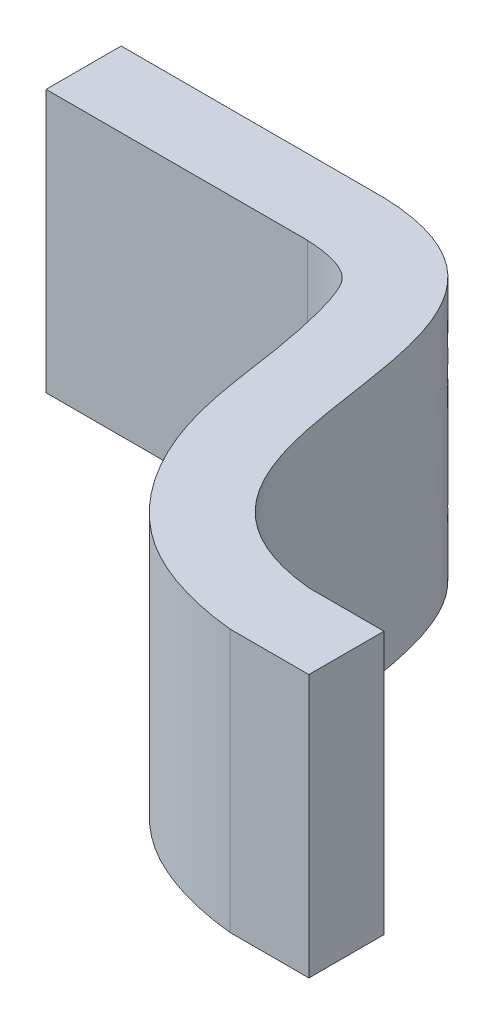
ISO-10303-21;
HEADER;
FILE_DESCRIPTION(('STEP AP214'),'2;1');
FILE_NAME('part.step','',(''),(''),'','','');
FILE_SCHEMA(('AUTOMOTIVE_DESIGN { 1 0 10303 214 1 1 1 1 }'));
ENDSEC;
DATA;
#1=APPLICATION_CONTEXT('core data for automotive mechanical design processes');
#2=APPLICATION_PROTOCOL_DEFINITION('international standard','automotive_design',2000,#1);
#3=PRODUCT_CONTEXT('',#1,'mechanical');
#4=PRODUCT('Part','Part','',(#3));
#5=PRODUCT_RELATED_PRODUCT_CATEGORY('part','',(#4));
#6=PRODUCT_DEFINITION_FORMATION('','',#4);
#7=PRODUCT_DEFINITION_CONTEXT('part definition',#1,'design');
#8=PRODUCT_DEFINITION('design','',#6,#7);
#9=PRODUCT_DEFINITION_SHAPE('','',#8);
#10=(LENGTH_UNIT() NAMED_UNIT(*) SI_UNIT(.MILLI.,.METRE.));
#11=(NAMED_UNIT(*) PLANE_ANGLE_UNIT() SI_UNIT($,.RADIAN.));
#12=(NAMED_UNIT(*) SI_UNIT($,.STERADIAN.) SOLID_ANGLE_UNIT());
#13=UNCERTAINTY_MEASURE_WITH_UNIT(LENGTH_MEASURE(1.E-05),#10,'distance_accuracy_value','');
#14=(GEOMETRIC_REPRESENTATION_CONTEXT(3) GLOBAL_UNCERTAINTY_ASSIGNED_CONTEXT((#13)) GLOBAL_UNIT_ASSIGNED_CONTEXT((#10,
#11,#12)) REPRESENTATION_CONTEXT('',''));
#15=CARTESIAN_POINT('',(0.,0.,0.));
#16=DIRECTION('',(0.,0.,1.));
#17=DIRECTION('',(1.,0.,0.));
#18=AXIS2_PLACEMENT_3D('',#15,#16,#17);
#19=CARTESIAN_POINT('',(0.381074398756027,-3.47690082967439,1.19999985356685));
#20=DIRECTION('',(0.,-1.,-4.37113882867379E-08));
#21=DIRECTION('',(1.,0.,0.));
#22=AXIS2_PLACEMENT_3D('',#19,#20,#21);
#23=PLANE('',#22);
#24=CARTESIAN_POINT('',(-6.65392560124397,-3.47690082093211,0.999999853566849));
#25=CARTESIAN_POINT('',(-6.6760213847098,-3.47690082083689,0.997821363378803));
#26=CARTESIAN_POINT('',(-6.69813368756547,-3.4769008206928,0.994524992319805));
#27=CARTESIAN_POINT('',(-6.74194760453987,-3.47690082027531,0.984973999806053));
#28=CARTESIAN_POINT('',(-6.76364199343851,-3.4769008200005,0.978687133446075));
#29=CARTESIAN_POINT('',(-6.8010868913745,-3.476900819368,0.964217061903684));
#30=CARTESIAN_POINT('',(-6.81710358266756,-3.47690081904135,0.956744157681285));
#31=CARTESIAN_POINT('',(-6.84769864594612,-3.47690081828303,0.939395910983816));
#32=CARTESIAN_POINT('',(-6.86228342605002,-3.47690081785186,0.929532028551955));
#33=CARTESIAN_POINT('',(-6.88912475678651,-3.47690081690445,0.907857820702243));
#34=CARTESIAN_POINT('',(-6.90144309560176,-3.47690081639156,0.896124080689932));
#35=CARTESIAN_POINT('',(-6.92409093426443,-3.47690081528685,0.870851202194943));
#36=CARTESIAN_POINT('',(-6.93441702178863,-3.4769008146949,0.857309032186523));
#37=CARTESIAN_POINT('',(-6.96671116783855,-3.47690081254812,0.808196393991896));
#38=CARTESIAN_POINT('',(-6.98363339651492,-3.47690081085059,0.769361408858455));
#39=CARTESIAN_POINT('',(-7.00636675343762,-3.47690080782166,0.700067620687221));
#40=CARTESIAN_POINT('',(-7.01392037587509,-3.47690080650928,0.670043871769162));
#41=CARTESIAN_POINT('',(-7.02679822502435,-3.476900803861,0.60945829127765));
#42=CARTESIAN_POINT('',(-7.03211866901882,-3.47690080252507,0.578895637360986));
#43=CARTESIAN_POINT('',(-7.04522373011164,-3.47690079894623,0.497021351625423));
#44=CARTESIAN_POINT('',(-7.05225323067938,-3.47690079669872,0.445604528778748));
#45=CARTESIAN_POINT('',(-7.06582589653957,-3.47690079334914,0.368975045837079));
#46=CARTESIAN_POINT('',(-7.07085237182357,-3.47690079223664,0.343524079365538));
#47=CARTESIAN_POINT('',(-7.08288891244714,-3.47690079003342,0.293120201610462));
#48=CARTESIAN_POINT('',(-7.0898957194452,-3.47690078894266,0.268166543683047));
#49=CARTESIAN_POINT('',(-7.10753002382366,-3.4769007867616,0.218269493752244));
#50=CARTESIAN_POINT('',(-7.11829723428463,-3.47690078567323,0.19337055401301));
#51=CARTESIAN_POINT('',(-7.13813270077437,-3.47690078413505,0.158181114031212));
#52=CARTESIAN_POINT('',(-7.14532993400949,-3.47690078363948,0.146843820328245));
#53=CARTESIAN_POINT('',(-7.16104748346313,-3.47690078269053,0.125134406221757));
#54=CARTESIAN_POINT('',(-7.1695665343253,-3.47690078223712,0.114761377771714));
#55=CARTESIAN_POINT('',(-7.19090199977994,-3.47690078124645,0.0920974605824846));
#56=CARTESIAN_POINT('',(-7.20421803422598,-3.47690078072935,0.080267898890818));
#57=CARTESIAN_POINT('',(-7.23279289498044,-3.47690077980915,0.0592160823492663));
#58=CARTESIAN_POINT('',(-7.24805496936829,-3.47690077940623,0.0499982715306265));
#59=CARTESIAN_POINT('',(-7.28054440722777,-3.47690077870131,0.0338716888207507));
#60=CARTESIAN_POINT('',(-7.29782779482495,-3.47690077840435,0.0270780092305757));
#61=CARTESIAN_POINT('',(-7.33319650573112,-3.47690077791998,0.0159969269530957));
#62=CARTESIAN_POINT('',(-7.35128360657443,-3.47690077773283,0.0117154108145125));
#63=CARTESIAN_POINT('',(-7.38352182929289,-3.4769007774817,0.00597036540082577));
#64=CARTESIAN_POINT('',(-7.39760256337062,-3.47690077739915,0.00408168117578831));
#65=CARTESIAN_POINT('',(-7.4257638425411,-3.4769007772789,0.00133069078066276));
#66=CARTESIAN_POINT('',(-7.43984365839325,-3.47690077724089,0.000461089362855164));
#67=CARTESIAN_POINT('',(-7.45392560124401,-3.47690077722073,-1.46433151940948E-07));
#68=B_SPLINE_CURVE_WITH_KNOTS('',3,(#24,#25,#26,#27,#28,#29,#30,#31,#32,#33,#34,#35,#36,#37,#38,
#39,#40,#41,#42,#43,#44,#45,#46,#47,#48,#49,#50,#51,#52,#53,#54,#55,#56,#57,#58,#59,#60,#61,#62,
#63,#64,#65,#66,#67),.UNSPECIFIED.,.F.,.F.,(4,2,2,2,2,2,2,2,2,2,2,2,2,2,2,2,2,2,2,2,2,4),(0.,
0.0667821137090888,0.134301214684032,0.187128508823994,0.239707439757743,0.290518731452934,
0.341416294675061,0.466712259088971,0.55956301965451,0.652570428897923,0.808245450373597,
0.886023921415196,0.963675157190788,1.04458784966541,1.08478909463837,1.12495209032638,
1.17807587168457,1.2312895104201,1.28677003517691,1.34238004906255,1.38496468867345,
1.42724258099923),.UNSPECIFIED.);
#69=CARTESIAN_POINT('',(-6.65392560124397,-3.47690082093211,0.999999853566849));
#70=VERTEX_POINT('',#69);
#71=CARTESIAN_POINT('',(-7.45392560124397,-3.47690077722073,-1.46433150760572E-07));
#72=VERTEX_POINT('',#71);
#73=EDGE_CURVE('E11',#70,#72,#68,.T.);
#74=ORIENTED_EDGE('',*,*,#73,.F.);
#75=DIRECTION('',(-1.,0.,0.));
#76=VECTOR('',#75,1.);
#77=CARTESIAN_POINT('',(-6.45392560124397,-3.47690082093211,0.999999853566849));
#78=LINE('',#77,#76);
#79=CARTESIAN_POINT('',(-6.45392560124397,-3.47690082093211,0.999999853566849));
#80=VERTEX_POINT('',#79);
#81=EDGE_CURVE('E178',#80,#70,#78,.T.);
#82=ORIENTED_EDGE('',*,*,#81,.F.);
#83=DIRECTION('',(0.,4.37113878426487E-08,-0.999999999999999));
#84=VECTOR('',#83,1.);
#85=CARTESIAN_POINT('',(-6.45392560124397,-3.47690082967439,1.19999985356685));
#86=LINE('',#85,#84);
#87=CARTESIAN_POINT('',(-6.45392560124397,-3.47690082967439,1.19999985356685));
#88=VERTEX_POINT('',#87);
#89=EDGE_CURVE('E154',#88,#80,#86,.T.);
#90=ORIENTED_EDGE('',*,*,#89,.F.);
#91=DIRECTION('',(-1.,0.,0.));
#92=VECTOR('',#91,1.);
#93=CARTESIAN_POINT('',(-6.45392560124397,-3.47690082967439,1.19999985356685));
#94=LINE('',#93,#92);
#95=CARTESIAN_POINT('',(-6.66372477809197,-3.47690082967439,1.19999985356685));
#96=VERTEX_POINT('',#95);
#97=EDGE_CURVE('E147',#88,#96,#94,.T.);
#98=ORIENTED_EDGE('',*,*,#97,.T.);
#99=CARTESIAN_POINT('',(-6.66372477809197,-3.47690082967439,1.19999985356685));
#100=CARTESIAN_POINT('',(-6.68235816480651,-3.47690082959388,1.19815800024526));
#101=CARTESIAN_POINT('',(-6.70093498946342,-3.47690082948649,1.1957012238173));
#102=CARTESIAN_POINT('',(-6.73791221278168,-3.47690082921529,1.18949682423011));
#103=CARTESIAN_POINT('',(-6.75631214417819,-3.47690082905135,1.18574642673535));
#104=CARTESIAN_POINT('',(-6.79295513620438,-3.47690082866298,1.1768614504023));
#105=CARTESIAN_POINT('',(-6.8111952940445,-3.47690082843801,1.17171471620827));
#106=CARTESIAN_POINT('',(-6.84717172345389,-3.47690082792288,1.15992992349783));
#107=CARTESIAN_POINT('',(-6.86490837899947,-3.47690082763277,1.15329303778762));
#108=CARTESIAN_POINT('',(-6.90549462665057,-3.47690082686923,1.13582532460973));
#109=CARTESIAN_POINT('',(-6.92807290255751,-3.47690082636693,1.12433411949993));
#110=CARTESIAN_POINT('',(-6.97096829666688,-3.4769008252108,1.09788489937365));
#111=CARTESIAN_POINT('',(-6.9912955036889,-3.47690082455769,1.08294336266544));
#112=CARTESIAN_POINT('',(-7.02796037846709,-3.4769008231845,1.05152836561377));
#113=CARTESIAN_POINT('',(-7.04448684621663,-3.47690082247389,1.0352716695965));
#114=CARTESIAN_POINT('',(-7.07542126022009,-3.47690082096671,1.00079135092781));
#115=CARTESIAN_POINT('',(-7.08982362168071,-3.47690082016992,0.982562754126248));
#116=CARTESIAN_POINT('',(-7.11808537102814,-3.47690081841041,0.942309972603254));
#117=CARTESIAN_POINT('',(-7.1316696505039,-3.47690081743928,0.92009318612408));
#118=CARTESIAN_POINT('',(-7.15605550233222,-3.47690081543449,0.87422897098033));
#119=CARTESIAN_POINT('',(-7.16686079670802,-3.47690081440092,0.850583508813256));
#120=CARTESIAN_POINT('',(-7.18656671922941,-3.47690081220073,0.800248980346848));
#121=CARTESIAN_POINT('',(-7.19523524065515,-3.47690081103018,0.773470089068371));
#122=CARTESIAN_POINT('',(-7.20995546192352,-3.47690080865782,0.719196833192921));
#123=CARTESIAN_POINT('',(-7.21600397870321,-3.47690080745597,0.691701641089337));
#124=CARTESIAN_POINT('',(-7.22444466903982,-3.47690080548969,0.646718436338351));
#125=CARTESIAN_POINT('',(-7.22735928328766,-3.47690080472924,0.629321297123909));
#126=CARTESIAN_POINT('',(-7.23280873084802,-3.47690080320562,0.594464888859918));
#127=CARTESIAN_POINT('',(-7.235343477908,-3.47690080244245,0.577005606618711));
#128=CARTESIAN_POINT('',(-7.24043139259136,-3.47690080091635,0.542092659422763));
#129=CARTESIAN_POINT('',(-7.24298455656837,-3.47690080015343,0.524638994034042));
#130=CARTESIAN_POINT('',(-7.24852784389109,-3.47690079863081,0.489805448400219));
#131=CARTESIAN_POINT('',(-7.25151784908981,-3.47690079787111,0.472425549508168));
#132=CARTESIAN_POINT('',(-7.2593930344497,-3.47690079601736,0.430016740032559));
#133=CARTESIAN_POINT('',(-7.26452884999095,-3.47690079492524,0.405032011816055));
#134=CARTESIAN_POINT('',(-7.27334542318719,-3.47690079329834,0.367812734985582));
#135=CARTESIAN_POINT('',(-7.27647049737491,-3.47690079275781,0.35544681434155));
#136=CARTESIAN_POINT('',(-7.28323298853228,-3.47690079168298,0.33085792341073));
#137=CARTESIAN_POINT('',(-7.28687011761276,-3.47690079114867,0.318634876950399));
#138=CARTESIAN_POINT('',(-7.29334407740757,-3.47690079030677,0.299373221215939));
#139=CARTESIAN_POINT('',(-7.2959066269859,-3.47690078999518,0.292243807444687));
#140=CARTESIAN_POINT('',(-7.30148473904446,-3.47690078937994,0.27817171935325));
#141=CARTESIAN_POINT('',(-7.30449961539945,-3.47690078907628,0.271228780663558));
#142=CARTESIAN_POINT('',(-7.31076754414832,-3.47690078854217,0.25899976841146));
#143=CARTESIAN_POINT('',(-7.31387365469767,-3.47690078830855,0.253644591727611));
#144=CARTESIAN_POINT('',(-7.32080381678023,-3.47690078789956,0.24431585073112));
#145=CARTESIAN_POINT('',(-7.32450000384901,-3.47690078772056,0.240253829951382));
#146=CARTESIAN_POINT('',(-7.33394897363332,-3.47690078736822,0.232075819782309));
#147=CARTESIAN_POINT('',(-7.33998642044214,-3.47690078721245,0.228303905554507));
#148=CARTESIAN_POINT('',(-7.34920308092036,-3.47690078697539,0.223112945284578));
#149=CARTESIAN_POINT('',(-7.35228960650534,-3.47690078689613,0.2214660138922));
#150=CARTESIAN_POINT('',(-7.35857989092758,-3.47690078677323,0.218417225329413));
#151=CARTESIAN_POINT('',(-7.36178332741555,-3.4769007867295,0.217014747998715));
#152=CARTESIAN_POINT('',(-7.37090352258754,-3.4769007866004,0.21346489598315));
#153=CARTESIAN_POINT('',(-7.37693693346537,-3.47690078650972,0.211621552848284));
#154=CARTESIAN_POINT('',(-7.38670569686491,-3.4769007863772,0.209137060916208));
#155=CARTESIAN_POINT('',(-7.39039887638499,-3.4769007863303,0.20830954664572));
#156=CARTESIAN_POINT('',(-7.39781445722382,-3.47690078625616,0.206799511724327));
#157=CARTESIAN_POINT('',(-7.40153685423347,-3.47690078622893,0.206116970094035));
#158=CARTESIAN_POINT('',(-7.41389968086125,-3.47690078614263,0.204031929793533));
#159=CARTESIAN_POINT('',(-7.42257948480063,-3.47690078608874,0.20286096389716));
#160=CARTESIAN_POINT('',(-7.43563044947402,-3.47690078602721,0.201476448842084));
#161=CARTESIAN_POINT('',(-7.43998307619468,-3.47690078600992,0.201077075020748));
#162=CARTESIAN_POINT('',(-7.44869872182374,-3.4769007859817,0.200423844313514));
#163=CARTESIAN_POINT('',(-7.45306173976726,-3.47690078597078,0.20016997440803));
#164=CARTESIAN_POINT('',(-7.45742938297997,-3.476900785963,0.199999853566849));
#165=B_SPLINE_CURVE_WITH_KNOTS('',3,(#99,#100,#101,#102,#103,#104,#105,#106,#107,#108,#109,#110,
#111,#112,#113,#114,#115,#116,#117,#118,#119,#120,#121,#122,#123,#124,#125,#126,#127,#128,#129,
#130,#131,#132,#133,#134,#135,#136,#137,#138,#139,#140,#141,#142,#143,#144,#145,#146,#147,#148,
#149,#150,#151,#152,#153,#154,#155,#156,#157,#158,#159,#160,#161,#162,#163,#164),.UNSPECIFIED.,
.F.,.F.,(4,2,2,2,2,2,2,2,2,2,2,2,2,2,2,2,2,2,2,2,2,2,2,2,2,2,2,2,2,2,2,2,4),(0.,
0.0561681589095707,0.112457534383138,0.16925357861237,0.226005077906886,0.301715004036544,
0.377070566346001,0.446424912055152,0.515958475234817,0.593880428548584,0.671697467408244,
0.75596451716301,0.84033365838221,0.89324779263184,0.946173923407372,0.999089848164164,
1.05199148781442,1.12847716172405,1.16673541076623,1.20497223539784,1.22769072756634,
1.25037510056687,1.26886797593494,1.28517999290264,1.30634908955327,1.3168513921173,
1.32732665061524,1.34619861049414,1.35755137220421,1.36890248990409,1.39515927363249,
1.40827024085607,1.42138003473644),.UNSPECIFIED.);
#166=CARTESIAN_POINT('',(-7.45742938297997,-3.476900785963,0.199999853566849));
#167=VERTEX_POINT('',#166);
#168=EDGE_CURVE('E196',#96,#167,#165,.T.);
#169=ORIENTED_EDGE('',*,*,#168,.T.);
#170=DIRECTION('',(1.,0.,0.));
#171=VECTOR('',#170,1.);
#172=CARTESIAN_POINT('',(-8.15392560124397,-3.476900785963,0.199999853566847));
#173=LINE('',#172,#171);
#174=CARTESIAN_POINT('',(-8.15392560124397,-3.476900785963,0.199999853566849));
#175=VERTEX_POINT('',#174);
#176=EDGE_CURVE('E102',#175,#167,#173,.T.);
#177=ORIENTED_EDGE('',*,*,#176,.F.);
#178=DIRECTION('',(0.,4.37113900630947E-08,-0.999999999999999));
#179=VECTOR('',#178,1.);
#180=CARTESIAN_POINT('',(-8.15392560124397,-3.476900785963,0.199999853566849));
#181=LINE('',#180,#179);
#182=CARTESIAN_POINT('',(-8.15392560124397,-3.47690077722073,-1.46433150760572E-07));
#183=VERTEX_POINT('',#182);
#184=EDGE_CURVE('E90',#175,#183,#181,.T.);
#185=ORIENTED_EDGE('',*,*,#184,.T.);
#186=DIRECTION('',(-1.,0.,0.));
#187=VECTOR('',#186,1.);
#188=CARTESIAN_POINT('',(-7.45392560124397,-3.47690077722073,-1.46433150760572E-07));
#189=LINE('',#188,#187);
#190=EDGE_CURVE('E100',#72,#183,#189,.T.);
#191=ORIENTED_EDGE('',*,*,#190,.F.);
#192=EDGE_LOOP('',(#74,#82,#90,#98,#169,#177,#185,#191));
#193=FACE_BOUND('',#192,.T.);
#194=ADVANCED_FACE('F17',(#193),#23,.T.);
#195=CARTESIAN_POINT('',(0.381074398756027,-2.77690082967439,1.19999988416482));
#196=DIRECTION('',(0.,-1.,-4.37113882867379E-08));
#197=DIRECTION('',(1.,0.,0.));
#198=AXIS2_PLACEMENT_3D('',#195,#196,#197);
#199=PLANE('',#198);
#200=DIRECTION('',(-1.,0.,0.));
#201=VECTOR('',#200,1.);
#202=CARTESIAN_POINT('',(-6.45392560124397,-2.77690082093212,0.999999884164821));
#203=LINE('',#202,#201);
#204=CARTESIAN_POINT('',(-6.45392560124397,-2.77690082093211,0.999999884164821));
#205=VERTEX_POINT('',#204);
#206=CARTESIAN_POINT('',(-6.65392560124397,-2.77690082093211,0.999999884164821));
#207=VERTEX_POINT('',#206);
#208=EDGE_CURVE('E30',#205,#207,#203,.T.);
#209=ORIENTED_EDGE('',*,*,#208,.T.);
#210=CARTESIAN_POINT('',(-6.65392560124397,-2.77690082093211,0.999999884164821));
#211=CARTESIAN_POINT('',(-6.6760213847098,-2.77690082083688,0.997821393976774));
#212=CARTESIAN_POINT('',(-6.69813368756547,-2.7769008206928,0.994525022917776));
#213=CARTESIAN_POINT('',(-6.74194760453987,-2.77690082027532,0.984974030404025));
#214=CARTESIAN_POINT('',(-6.76364199343851,-2.77690082000051,0.978687164044047));
#215=CARTESIAN_POINT('',(-6.8010868913745,-2.776900819368,0.964217092501656));
#216=CARTESIAN_POINT('',(-6.81710358266756,-2.77690081904135,0.956744188279256));
#217=CARTESIAN_POINT('',(-6.84769864594612,-2.77690081828303,0.939395941581787));
#218=CARTESIAN_POINT('',(-6.86228342605002,-2.77690081785186,0.929532059149927));
#219=CARTESIAN_POINT('',(-6.88912475678651,-2.77690081690445,0.907857851300215));
#220=CARTESIAN_POINT('',(-6.90144309560176,-2.77690081639156,0.896124111287903));
#221=CARTESIAN_POINT('',(-6.92409093426443,-2.77690081528685,0.870851232792914));
#222=CARTESIAN_POINT('',(-6.93441702178863,-2.7769008146949,0.857309062784495));
#223=CARTESIAN_POINT('',(-6.96671116783855,-2.77690081254811,0.808196424589869));
#224=CARTESIAN_POINT('',(-6.98363339651492,-2.77690081085059,0.769361439456426));
#225=CARTESIAN_POINT('',(-7.00636675343762,-2.77690080782166,0.700067651285191));
#226=CARTESIAN_POINT('',(-7.01392037587509,-2.77690080650928,0.670043902367133));
#227=CARTESIAN_POINT('',(-7.02679822502435,-2.776900803861,0.609458321875621));
#228=CARTESIAN_POINT('',(-7.03211866901882,-2.77690080252507,0.578895667958958));
#229=CARTESIAN_POINT('',(-7.04522373011164,-2.77690079894623,0.497021382223394));
#230=CARTESIAN_POINT('',(-7.05225323067938,-2.77690079669873,0.445604559376719));
#231=CARTESIAN_POINT('',(-7.06582589653957,-2.77690079334914,0.368975076435051));
#232=CARTESIAN_POINT('',(-7.07085237182358,-2.77690079223665,0.34352410996351));
#233=CARTESIAN_POINT('',(-7.08288891244714,-2.77690079003342,0.293120232208435));
#234=CARTESIAN_POINT('',(-7.0898957194452,-2.77690078894266,0.26816657428102));
#235=CARTESIAN_POINT('',(-7.10753002382366,-2.77690078676159,0.218269524350215));
#236=CARTESIAN_POINT('',(-7.11829723428463,-2.77690078567323,0.19337058461098));
#237=CARTESIAN_POINT('',(-7.13813270077437,-2.77690078413505,0.158181144629183));
#238=CARTESIAN_POINT('',(-7.14532993400949,-2.77690078363948,0.146843850926217));
#239=CARTESIAN_POINT('',(-7.16104748346313,-2.77690078269053,0.125134436819728));
#240=CARTESIAN_POINT('',(-7.1695665343253,-2.77690078223712,0.114761408369686));
#241=CARTESIAN_POINT('',(-7.19090199977994,-2.77690078124645,0.0920974911804555));
#242=CARTESIAN_POINT('',(-7.20421803422598,-2.77690078072935,0.0802679294887893));
#243=CARTESIAN_POINT('',(-7.23279289498045,-2.77690077980915,0.0592161129472383));
#244=CARTESIAN_POINT('',(-7.24805496936829,-2.77690077940623,0.0499983021285984));
#245=CARTESIAN_POINT('',(-7.28054440722777,-2.77690077870131,0.0338717194187224));
#246=CARTESIAN_POINT('',(-7.29782779482495,-2.77690077840435,0.0270780398285472));
#247=CARTESIAN_POINT('',(-7.33319650573112,-2.77690077791998,0.0159969575510673));
#248=CARTESIAN_POINT('',(-7.35128360657443,-2.77690077773283,0.0117154414124843));
#249=CARTESIAN_POINT('',(-7.38352182929289,-2.7769007774817,0.00597039599879767));
#250=CARTESIAN_POINT('',(-7.39760256337062,-2.77690077739915,0.00408171177376016));
#251=CARTESIAN_POINT('',(-7.4257638425411,-2.7769007772789,0.00133072137863451));
#252=CARTESIAN_POINT('',(-7.43984365839325,-2.77690077724089,0.000461119960826874));
#253=CARTESIAN_POINT('',(-7.45392560124401,-2.77690077722073,-1.1583518018464E-07));
#254=B_SPLINE_CURVE_WITH_KNOTS('',3,(#210,#211,#212,#213,#214,#215,#216,#217,#218,#219,#220,
#221,#222,#223,#224,#225,#226,#227,#228,#229,#230,#231,#232,#233,#234,#235,#236,#237,#238,#239,
#240,#241,#242,#243,#244,#245,#246,#247,#248,#249,#250,#251,#252,#253),.UNSPECIFIED.,.F.,.F.,(4,
2,2,2,2,2,2,2,2,2,2,2,2,2,2,2,2,2,2,2,2,4),(0.,0.0667821137090889,0.134301214684032,
0.187128508823994,0.239707439757743,0.290518731452934,0.34141629467506,0.466712259088972,
0.55956301965451,0.652570428897923,0.808245450373596,0.886023921415196,0.963675157190788,
1.04458784966541,1.08478909463837,1.12495209032638,1.17807587168457,1.2312895104201,
1.28677003517691,1.34238004906255,1.38496468867345,1.42724258099923),.UNSPECIFIED.);
#255=CARTESIAN_POINT('',(-7.45392560124397,-2.77690077722073,-1.15835178959856E-07));
#256=VERTEX_POINT('',#255);
#257=EDGE_CURVE('E157',#207,#256,#254,.T.);
#258=ORIENTED_EDGE('',*,*,#257,.T.);
#259=DIRECTION('',(-1.,0.,0.));
#260=VECTOR('',#259,1.);
#261=CARTESIAN_POINT('',(-7.45392560124397,-2.77690077722073,-1.15835178959856E-07));
#262=LINE('',#261,#260);
#263=CARTESIAN_POINT('',(-8.15392560124397,-2.77690077722073,-1.15835178959856E-07));
#264=VERTEX_POINT('',#263);
#265=EDGE_CURVE('E150',#256,#264,#262,.T.);
#266=ORIENTED_EDGE('',*,*,#265,.T.);
#267=DIRECTION('',(0.,4.37113878426487E-08,-0.999999999999999));
#268=VECTOR('',#267,1.);
#269=CARTESIAN_POINT('',(-8.15392560124397,-2.776900785963,0.199999884164821));
#270=LINE('',#269,#268);
#271=CARTESIAN_POINT('',(-8.15392560124397,-2.776900785963,0.199999884164821));
#272=VERTEX_POINT('',#271);
#273=EDGE_CURVE('E93',#272,#264,#270,.T.);
#274=ORIENTED_EDGE('',*,*,#273,.F.);
#275=DIRECTION('',(1.,0.,0.));
#276=VECTOR('',#275,1.);
#277=CARTESIAN_POINT('',(-8.15392560124397,-2.77690078596301,0.199999884164819));
#278=LINE('',#277,#276);
#279=CARTESIAN_POINT('',(-7.45742938297997,-2.776900785963,0.199999884164821));
#280=VERTEX_POINT('',#279);
#281=EDGE_CURVE('E193',#272,#280,#278,.T.);
#282=ORIENTED_EDGE('',*,*,#281,.T.);
#283=CARTESIAN_POINT('',(-6.66372477809197,-2.77690082967439,1.19999988416482));
#284=CARTESIAN_POINT('',(-6.68235816480651,-2.77690082959388,1.19815803084323));
#285=CARTESIAN_POINT('',(-6.70093498946342,-2.77690082948649,1.19570125441527));
#286=CARTESIAN_POINT('',(-6.73791221278168,-2.77690082921529,1.18949685482808));
#287=CARTESIAN_POINT('',(-6.75631214417819,-2.77690082905135,1.18574645733332));
#288=CARTESIAN_POINT('',(-6.79295513620438,-2.77690082866298,1.17686148100027));
#289=CARTESIAN_POINT('',(-6.8111952940445,-2.77690082843801,1.17171474680624));
#290=CARTESIAN_POINT('',(-6.84717172345389,-2.77690082792288,1.1599299540958));
#291=CARTESIAN_POINT('',(-6.86490837899947,-2.77690082763277,1.1532930683856));
#292=CARTESIAN_POINT('',(-6.90549462665057,-2.77690082686923,1.1358253552077));
#293=CARTESIAN_POINT('',(-6.92807290255751,-2.77690082636694,1.1243341500979));
#294=CARTESIAN_POINT('',(-6.97096829666688,-2.77690082521081,1.09788492997162));
#295=CARTESIAN_POINT('',(-6.9912955036889,-2.77690082455769,1.08294339326342));
#296=CARTESIAN_POINT('',(-7.02796037846709,-2.7769008231845,1.05152839621174));
#297=CARTESIAN_POINT('',(-7.04448684621663,-2.77690082247389,1.03527170019447));
#298=CARTESIAN_POINT('',(-7.07542126022009,-2.77690082096671,1.00079138152578));
#299=CARTESIAN_POINT('',(-7.08982362168071,-2.77690082016992,0.982562784724219));
#300=CARTESIAN_POINT('',(-7.11808537102814,-2.77690081841041,0.942310003201225));
#301=CARTESIAN_POINT('',(-7.1316696505039,-2.77690081743928,0.920093216722051));
#302=CARTESIAN_POINT('',(-7.15605550233222,-2.77690081543449,0.874229001578301));
#303=CARTESIAN_POINT('',(-7.16686079670802,-2.77690081440092,0.850583539411227));
#304=CARTESIAN_POINT('',(-7.18656671922941,-2.77690081220073,0.80024901094482));
#305=CARTESIAN_POINT('',(-7.19523524065514,-2.77690081103018,0.773470119666343));
#306=CARTESIAN_POINT('',(-7.20995546192352,-2.77690080865782,0.719196863790893));
#307=CARTESIAN_POINT('',(-7.21600397870321,-2.77690080745597,0.691701671687309));
#308=CARTESIAN_POINT('',(-7.22444466903982,-2.77690080548969,0.646718466936323));
#309=CARTESIAN_POINT('',(-7.22735928328766,-2.77690080472924,0.629321327721881));
#310=CARTESIAN_POINT('',(-7.23280873084802,-2.77690080320562,0.59446491945789));
#311=CARTESIAN_POINT('',(-7.23534347790799,-2.77690080244245,0.577005637216683));
#312=CARTESIAN_POINT('',(-7.24043139259136,-2.77690080091635,0.542092690020735));
#313=CARTESIAN_POINT('',(-7.24298455656837,-2.77690080015343,0.524639024632014));
#314=CARTESIAN_POINT('',(-7.24852784389109,-2.77690079863081,0.489805478998191));
#315=CARTESIAN_POINT('',(-7.25151784908981,-2.77690079787111,0.47242558010614));
#316=CARTESIAN_POINT('',(-7.2593930344497,-2.77690079601736,0.430016770630531));
#317=CARTESIAN_POINT('',(-7.26452884999095,-2.77690079492523,0.405032042414026));
#318=CARTESIAN_POINT('',(-7.27334542318719,-2.77690079329834,0.367812765583553));
#319=CARTESIAN_POINT('',(-7.27647049737492,-2.77690079275782,0.355446844939521));
#320=CARTESIAN_POINT('',(-7.28323298853228,-2.77690079168297,0.330857954008701));
#321=CARTESIAN_POINT('',(-7.28687011761276,-2.77690079114864,0.31863490754837));
#322=CARTESIAN_POINT('',(-7.29334407740757,-2.77690079030678,0.29937325181391));
#323=CARTESIAN_POINT('',(-7.2959066269859,-2.77690078999522,0.292243838042658));
#324=CARTESIAN_POINT('',(-7.30148473904446,-2.7769007893799,0.278171749951221));
#325=CARTESIAN_POINT('',(-7.30449961539945,-2.77690078907615,0.271228811261528));
#326=CARTESIAN_POINT('',(-7.31076754414832,-2.77690078854228,0.258999799009431));
#327=CARTESIAN_POINT('',(-7.31387365469767,-2.77690078830893,0.253644622325583));
#328=CARTESIAN_POINT('',(-7.32080381678023,-2.77690078789924,0.244315881329092));
#329=CARTESIAN_POINT('',(-7.32450000384901,-2.77690078771943,0.240253860549354));
#330=CARTESIAN_POINT('',(-7.33394897363332,-2.77690078736998,0.232075850380281));
#331=CARTESIAN_POINT('',(-7.33998642044214,-2.77690078721932,0.228303936152478));
#332=CARTESIAN_POINT('',(-7.34920308092036,-2.77690078697656,0.22311297588255));
#333=CARTESIAN_POINT('',(-7.35228960650534,-2.77690078689321,0.221466044490173));
#334=CARTESIAN_POINT('',(-7.35857989092758,-2.77690078677614,0.218417255927385));
#335=CARTESIAN_POINT('',(-7.36178332741555,-2.7769007867423,0.217014778596688));
#336=CARTESIAN_POINT('',(-7.37090352258754,-2.77690078662785,0.213464926581121));
#337=CARTESIAN_POINT('',(-7.37693693346537,-2.77690078653148,0.211621583446255));
#338=CARTESIAN_POINT('',(-7.38670569686491,-2.77690078638551,0.20913709151418));
#339=CARTESIAN_POINT('',(-7.39039887638499,-2.77690078633258,0.208309577243692));
#340=CARTESIAN_POINT('',(-7.39781445722382,-2.77690078625388,0.206799542322299));
#341=CARTESIAN_POINT('',(-7.40153685423347,-2.7769007862281,0.206117000692007));
#342=CARTESIAN_POINT('',(-7.41389968086125,-2.77690078614453,0.204031960391505));
#343=CARTESIAN_POINT('',(-7.42257948480063,-2.77690078608912,0.202860994495132));
#344=CARTESIAN_POINT('',(-7.43563044947402,-2.77690078602702,0.201476479440056));
#345=CARTESIAN_POINT('',(-7.43998307619468,-2.77690078600983,0.20107710561872));
#346=CARTESIAN_POINT('',(-7.44869872182374,-2.7769007859818,0.200423874911486));
#347=CARTESIAN_POINT('',(-7.45306173976726,-2.77690078597097,0.200170005006001));
#348=CARTESIAN_POINT('',(-7.45742938297997,-2.77690078596301,0.199999884164821));
#349=B_SPLINE_CURVE_WITH_KNOTS('',3,(#283,#284,#285,#286,#287,#288,#289,#290,#291,#292,#293,
#294,#295,#296,#297,#298,#299,#300,#301,#302,#303,#304,#305,#306,#307,#308,#309,#310,#311,#312,
#313,#314,#315,#316,#317,#318,#319,#320,#321,#322,#323,#324,#325,#326,#327,#328,#329,#330,#331,
#332,#333,#334,#335,#336,#337,#338,#339,#340,#341,#342,#343,#344,#345,#346,#347,#348),
.UNSPECIFIED.,.F.,.F.,(4,2,2,2,2,2,2,2,2,2,2,2,2,2,2,2,2,2,2,2,2,2,2,2,2,2,2,2,2,2,2,2,4),(0.,
0.0561681589095703,0.112457534383137,0.169253578612369,0.226005077906886,0.301715004036545,
0.377070566346002,0.446424912055152,0.515958475234817,0.593880428548584,0.671697467408243,
0.755964517163009,0.840333658382209,0.893247792631839,0.946173923407371,0.999089848164162,
1.05199148781442,1.12847716172405,1.16673541076623,1.20497223539784,1.22769072756634,
1.25037510056687,1.26886797593494,1.28517999290264,1.30634908955327,1.31685139211729,
1.32732665061524,1.34619861049414,1.35755137220421,1.36890248990409,1.39515927363249,
1.40827024085607,1.42138003473644),.UNSPECIFIED.);
#350=CARTESIAN_POINT('',(-6.66372477809197,-2.77690082967439,1.19999988416482));
#351=VERTEX_POINT('',#350);
#352=EDGE_CURVE('E98',#351,#280,#349,.T.);
#353=ORIENTED_EDGE('',*,*,#352,.F.);
#354=DIRECTION('',(-1.,0.,0.));
#355=VECTOR('',#354,1.);
#356=CARTESIAN_POINT('',(-6.45392560124397,-2.7769008296744,1.19999988416482));
#357=LINE('',#356,#355);
#358=CARTESIAN_POINT('',(-6.45392560124397,-2.77690082967439,1.19999988416482));
#359=VERTEX_POINT('',#358);
#360=EDGE_CURVE('E163',#359,#351,#357,.T.);
#361=ORIENTED_EDGE('',*,*,#360,.F.);
#362=DIRECTION('',(0.,4.37113878426487E-08,-0.999999999999999));
#363=VECTOR('',#362,1.);
#364=CARTESIAN_POINT('',(-6.45392560124397,-2.77690082967439,1.19999988416482));
#365=LINE('',#364,#363);
#366=EDGE_CURVE('E197',#359,#205,#365,.T.);
#367=ORIENTED_EDGE('',*,*,#366,.T.);
#368=EDGE_LOOP('',(#209,#258,#266,#274,#282,#353,#361,#367));
#369=FACE_BOUND('',#368,.T.);
#370=ADVANCED_FACE('F120',(#369),#199,.F.);
#371=CARTESIAN_POINT('',(0.381074398756027,-0.126900829674392,1.2));
#372=DIRECTION('',(0.,-4.37113882867379E-08,1.));
#373=DIRECTION('',(0.,-1.,-4.37113882867379E-08));
#374=AXIS2_PLACEMENT_3D('',#371,#372,#373);
#375=PLANE('',#374);
#376=ORIENTED_EDGE('',*,*,#360,.T.);
#377=DIRECTION('',(0.,-0.999999999999999,-4.37113881598552E-08));
#378=VECTOR('',#377,1.);
#379=CARTESIAN_POINT('',(-6.66372477809197,-2.77690082967439,1.19999988416482));
#380=LINE('',#379,#378);
#381=EDGE_CURVE('E152',#351,#96,#380,.T.);
#382=ORIENTED_EDGE('',*,*,#381,.T.);
#383=ORIENTED_EDGE('',*,*,#97,.F.);
#384=DIRECTION('',(0.,0.999999999999999,4.37113881598552E-08));
#385=VECTOR('',#384,1.);
#386=CARTESIAN_POINT('',(-6.45392560124397,-3.47690082967439,1.19999985356685));
#387=LINE('',#386,#385);
#388=EDGE_CURVE('E191',#88,#359,#387,.T.);
#389=ORIENTED_EDGE('',*,*,#388,.T.);
#390=EDGE_LOOP('',(#376,#382,#383,#389));
#391=FACE_BOUND('',#390,.T.);
#392=ADVANCED_FACE('F171',(#391),#375,.T.);
#393=CARTESIAN_POINT('',(-6.45392560124397,-0.126900829674392,1.2));
#394=DIRECTION('',(-1.,0.,0.));
#395=DIRECTION('',(0.,-1.,-4.37113882867379E-08));
#396=AXIS2_PLACEMENT_3D('',#393,#394,#395);
#397=PLANE('',#396);
#398=ORIENTED_EDGE('',*,*,#89,.T.);
#399=DIRECTION('',(0.,-0.999999999999999,-4.3711388159856E-08));
#400=VECTOR('',#399,1.);
#401=CARTESIAN_POINT('',(-6.45392560124397,-2.77690082093212,0.999999884164821));
#402=LINE('',#401,#400);
#403=EDGE_CURVE('E139',#205,#80,#402,.T.);
#404=ORIENTED_EDGE('',*,*,#403,.F.);
#405=ORIENTED_EDGE('',*,*,#366,.F.);
#406=ORIENTED_EDGE('',*,*,#388,.F.);
#407=EDGE_LOOP('',(#398,#404,#405,#406));
#408=FACE_BOUND('',#407,.T.);
#409=ADVANCED_FACE('F209',(#408),#397,.F.);
#410=CARTESIAN_POINT('',(-8.15392560124397,-0.126900829674392,1.2));
#411=DIRECTION('',(-1.,0.,0.));
#412=DIRECTION('',(0.,-1.,-4.37113882867379E-08));
#413=AXIS2_PLACEMENT_3D('',#410,#411,#412);
#414=PLANE('',#413);
#415=DIRECTION('',(0.,-0.999999999999999,-4.37113886356658E-08));
#416=VECTOR('',#415,1.);
#417=CARTESIAN_POINT('',(-8.15392560124398,-2.77690078596301,0.199999884164821));
#418=LINE('',#417,#416);
#419=EDGE_CURVE('E145',#272,#175,#418,.T.);
#420=ORIENTED_EDGE('',*,*,#419,.F.);
#421=ORIENTED_EDGE('',*,*,#273,.T.);
#422=DIRECTION('',(0.,0.999999999999999,4.37113882867379E-08));
#423=VECTOR('',#422,1.);
#424=CARTESIAN_POINT('',(-8.15392560124397,-3.47690077722073,-1.46433150760572E-07));
#425=LINE('',#424,#423);
#426=EDGE_CURVE('E87',#183,#264,#425,.T.);
#427=ORIENTED_EDGE('',*,*,#426,.F.);
#428=ORIENTED_EDGE('',*,*,#184,.F.);
#429=EDGE_LOOP('',(#420,#421,#427,#428));
#430=FACE_BOUND('',#429,.T.);
#431=ADVANCED_FACE('F89',(#430),#414,.T.);
#432=CARTESIAN_POINT('',(0.381074398756027,-0.126900777220726,0.));
#433=DIRECTION('',(0.,-4.37113882867379E-08,1.));
#434=DIRECTION('',(0.,-1.,-4.37113882867379E-08));
#435=AXIS2_PLACEMENT_3D('',#432,#433,#434);
#436=PLANE('',#435);
#437=ORIENTED_EDGE('',*,*,#265,.F.);
#438=DIRECTION('',(0.,-0.999999999999999,-4.37113882867379E-08));
#439=VECTOR('',#438,1.);
#440=CARTESIAN_POINT('',(-7.45392560124397,-2.77690077722073,-1.15835178959856E-07));
#441=LINE('',#440,#439);
#442=EDGE_CURVE('E97',#256,#72,#441,.T.);
#443=ORIENTED_EDGE('',*,*,#442,.T.);
#444=ORIENTED_EDGE('',*,*,#190,.T.);
#445=ORIENTED_EDGE('',*,*,#426,.T.);
#446=EDGE_LOOP('',(#437,#443,#444,#445));
#447=FACE_BOUND('',#446,.T.);
#448=ADVANCED_FACE('F105',(#447),#436,.F.);
#449=CARTESIAN_POINT('',(0.381074398756027,5.01772964056189,1.00000022487894));
#450=DIRECTION('',(0.,-4.37113882867379E-08,1.));
#451=DIRECTION('',(0.,-1.,-4.37113882867379E-08));
#452=AXIS2_PLACEMENT_3D('',#449,#450,#451);
#453=PLANE('',#452);
#454=ORIENTED_EDGE('',*,*,#403,.T.);
#455=ORIENTED_EDGE('',*,*,#81,.T.);
#456=DIRECTION('',(0.,-0.999999999999999,-4.3711388159856E-08));
#457=VECTOR('',#456,1.);
#458=CARTESIAN_POINT('',(-6.65392560124397,-2.77690082093212,0.999999884164821));
#459=LINE('',#458,#457);
#460=EDGE_CURVE('E103',#207,#70,#459,.T.);
#461=ORIENTED_EDGE('',*,*,#460,.F.);
#462=ORIENTED_EDGE('',*,*,#208,.F.);
#463=EDGE_LOOP('',(#454,#455,#461,#462));
#464=FACE_BOUND('',#463,.T.);
#465=ADVANCED_FACE('F169',(#464),#453,.F.);
#466=CARTESIAN_POINT('',(-6.65392560124397,5.01772964056189,1.00000022487894));
#467=CARTESIAN_POINT('',(-7.29924299938797,5.01772964333266,0.93661226287194));
#468=CARTESIAN_POINT('',(-6.78982889187097,5.01772968333384,0.0214920441178097));
#469=CARTESIAN_POINT('',(-7.45392560124397,5.01772968427327,2.24878939694144E-07));
#470=B_SPLINE_CURVE_WITH_KNOTS('',3,(#466,#467,#468,#469),.UNSPECIFIED.,.F.,.F.,(4,4),(0.,1.),.UNSPECIFIED.);
#471=DIRECTION('',(0.,-0.999999999999999,-4.37113882867379E-08));
#472=VECTOR('',#471,1.);
#473=SURFACE_OF_LINEAR_EXTRUSION('',#470,#472);
#474=ORIENTED_EDGE('',*,*,#460,.T.);
#475=ORIENTED_EDGE('',*,*,#73,.T.);
#476=ORIENTED_EDGE('',*,*,#442,.F.);
#477=ORIENTED_EDGE('',*,*,#257,.F.);
#478=EDGE_LOOP('',(#474,#475,#476,#477));
#479=FACE_BOUND('',#478,.T.);
#480=ADVANCED_FACE('F165',(#479),#473,.F.);
#481=CARTESIAN_POINT('',(0.381074398756027,5.017729675531,0.20000022487894));
#482=DIRECTION('',(0.,4.37113882867379E-08,-1.));
#483=DIRECTION('',(1.,0.,0.));
#484=AXIS2_PLACEMENT_3D('',#481,#482,#483);
#485=PLANE('',#484);
#486=ORIENTED_EDGE('',*,*,#419,.T.);
#487=ORIENTED_EDGE('',*,*,#176,.T.);
#488=DIRECTION('',(0.,-0.999999999999999,-4.37113886356658E-08));
#489=VECTOR('',#488,1.);
#490=CARTESIAN_POINT('',(-7.45742938297997,-2.77690078596301,0.199999884164821));
#491=LINE('',#490,#489);
#492=EDGE_CURVE('E107',#280,#167,#491,.T.);
#493=ORIENTED_EDGE('',*,*,#492,.F.);
#494=ORIENTED_EDGE('',*,*,#281,.F.);
#495=EDGE_LOOP('',(#486,#487,#493,#494));
#496=FACE_BOUND('',#495,.T.);
#497=ADVANCED_FACE('F128',(#496),#485,.F.);
#498=CARTESIAN_POINT('',(-6.66372477809197,5.01772963181961,1.20000022487894));
#499=CARTESIAN_POINT('',(-6.76109917959897,5.0177296322377,1.19043537372094));
#500=CARTESIAN_POINT('',(-6.96544759492897,5.01772963465043,1.13523848292794));
#501=CARTESIAN_POINT('',(-7.20604035748997,5.01772964683219,0.85655227210794));
#502=CARTESIAN_POINT('',(-7.23833742725997,5.01772966268883,0.49379478761794));
#503=CARTESIAN_POINT('',(-7.29818549189797,5.01772967295241,0.25899132482694));
#504=CARTESIAN_POINT('',(-7.33604209899997,5.01772967426447,0.22897490490494));
#505=CARTESIAN_POINT('',(-7.37898312658797,5.01772967516896,0.20828275194794));
#506=CARTESIAN_POINT('',(-7.43389149863997,5.01772967549165,0.20090043049794));
#507=CARTESIAN_POINT('',(-7.45742938297997,5.017729675531,0.20000022487894));
#508=B_SPLINE_CURVE_WITH_KNOTS('',3,(#498,#499,#500,#501,#502,#503,#504,#505,#506,#507),
.UNSPECIFIED.,.F.,.F.,(4,1,1,1,1,1,1,4),(-0.005037439357121,0.120331553469,0.245700546295,
0.496438531947,0.747176517599,0.872545510425,0.935230006838,0.997914503251),.UNSPECIFIED.);
#509=DIRECTION('',(0.,-0.999999999999999,-4.37113882867379E-08));
#510=VECTOR('',#509,1.);
#511=SURFACE_OF_LINEAR_EXTRUSION('',#508,#510);
#512=ORIENTED_EDGE('',*,*,#352,.T.);
#513=ORIENTED_EDGE('',*,*,#492,.T.);
#514=ORIENTED_EDGE('',*,*,#168,.F.);
#515=ORIENTED_EDGE('',*,*,#381,.F.);
#516=EDGE_LOOP('',(#512,#513,#514,#515));
#517=FACE_BOUND('',#516,.T.);
#518=ADVANCED_FACE('F122',(#517),#511,.T.);
#519=CLOSED_SHELL('',(#194,#370,#392,#409,#431,#448,#465,#480,#497,#518));
#520=MANIFOLD_SOLID_BREP('B1',#519);
#521=ADVANCED_BREP_SHAPE_REPRESENTATION('',(#18,#520),#14);
#522=SHAPE_DEFINITION_REPRESENTATION(#9,#521);
ENDSEC;
END-ISO-10303-21;
